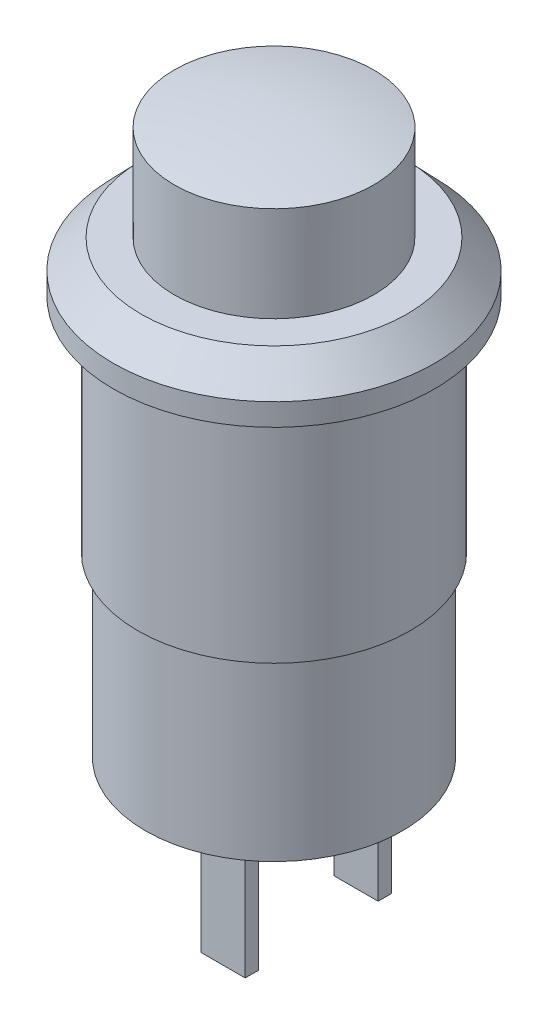
ISO-10303-21;
HEADER;
FILE_DESCRIPTION(('STEP AP214'),'2;1');
FILE_NAME('part.step','',(''),(''),'','','');
FILE_SCHEMA(('AUTOMOTIVE_DESIGN { 1 0 10303 214 1 1 1 1 }'));
ENDSEC;
DATA;
#1=APPLICATION_CONTEXT('core data for automotive mechanical design processes');
#2=APPLICATION_PROTOCOL_DEFINITION('international standard','automotive_design',2000,#1);
#3=PRODUCT_CONTEXT('',#1,'mechanical');
#4=PRODUCT('Part','Part','',(#3));
#5=PRODUCT_RELATED_PRODUCT_CATEGORY('part','',(#4));
#6=PRODUCT_DEFINITION_FORMATION('','',#4);
#7=PRODUCT_DEFINITION_CONTEXT('part definition',#1,'design');
#8=PRODUCT_DEFINITION('design','',#6,#7);
#9=PRODUCT_DEFINITION_SHAPE('','',#8);
#10=(LENGTH_UNIT() NAMED_UNIT(*) SI_UNIT(.MILLI.,.METRE.));
#11=(NAMED_UNIT(*) PLANE_ANGLE_UNIT() SI_UNIT($,.RADIAN.));
#12=(NAMED_UNIT(*) SI_UNIT($,.STERADIAN.) SOLID_ANGLE_UNIT());
#13=UNCERTAINTY_MEASURE_WITH_UNIT(LENGTH_MEASURE(1.E-05),#10,'distance_accuracy_value','');
#14=(GEOMETRIC_REPRESENTATION_CONTEXT(3) GLOBAL_UNCERTAINTY_ASSIGNED_CONTEXT((#13)) GLOBAL_UNIT_ASSIGNED_CONTEXT((#10,
#11,#12)) REPRESENTATION_CONTEXT('',''));
#15=CARTESIAN_POINT('',(0.,0.,0.));
#16=DIRECTION('',(0.,0.,1.));
#17=DIRECTION('',(1.,0.,0.));
#18=AXIS2_PLACEMENT_3D('',#15,#16,#17);
#19=CARTESIAN_POINT('',(-5.8,-18.,0.));
#20=DIRECTION('',(0.,-1.,0.));
#21=DIRECTION('',(0.,0.,-1.));
#22=AXIS2_PLACEMENT_3D('',#19,#20,#21);
#23=PLANE('',#22);
#24=CARTESIAN_POINT('',(0.,-18.,0.));
#25=DIRECTION('',(0.,1.,0.));
#26=DIRECTION('',(0.,0.,1.));
#27=AXIS2_PLACEMENT_3D('',#24,#25,#26);
#28=CIRCLE('',#27,5.8);
#29=CARTESIAN_POINT('',(0.,-18.,5.8));
#30=VERTEX_POINT('',#29);
#31=EDGE_CURVE('E11',#30,#30,#28,.T.);
#32=ORIENTED_EDGE('',*,*,#31,.F.);
#33=EDGE_LOOP('',(#32));
#34=FACE_BOUND('',#33,.T.);
#35=DIRECTION('',(1.,0.,0.));
#36=VECTOR('',#35,1.);
#37=CARTESIAN_POINT('',(0.,-18.,2.7));
#38=LINE('',#37,#36);
#39=CARTESIAN_POINT('',(0.,-18.,2.7));
#40=VERTEX_POINT('',#39);
#41=CARTESIAN_POINT('',(2.,-18.,2.7));
#42=VERTEX_POINT('',#41);
#43=EDGE_CURVE('E143',#40,#42,#38,.T.);
#44=ORIENTED_EDGE('',*,*,#43,.F.);
#45=DIRECTION('',(0.,0.,-1.));
#46=VECTOR('',#45,1.);
#47=CARTESIAN_POINT('',(0.,-18.,3.3));
#48=LINE('',#47,#46);
#49=CARTESIAN_POINT('',(0.,-18.,3.3));
#50=VERTEX_POINT('',#49);
#51=EDGE_CURVE('E138',#50,#40,#48,.T.);
#52=ORIENTED_EDGE('',*,*,#51,.F.);
#53=DIRECTION('',(-1.,0.,0.));
#54=VECTOR('',#53,1.);
#55=CARTESIAN_POINT('',(0.,-18.,3.3));
#56=LINE('',#55,#54);
#57=CARTESIAN_POINT('',(2.,-18.,3.3));
#58=VERTEX_POINT('',#57);
#59=EDGE_CURVE('E152',#58,#50,#56,.T.);
#60=ORIENTED_EDGE('',*,*,#59,.F.);
#61=DIRECTION('',(0.,0.,1.));
#62=VECTOR('',#61,1.);
#63=CARTESIAN_POINT('',(2.,-18.,3.3));
#64=LINE('',#63,#62);
#65=EDGE_CURVE('E161',#42,#58,#64,.T.);
#66=ORIENTED_EDGE('',*,*,#65,.F.);
#67=EDGE_LOOP('',(#44,#52,#60,#66));
#68=FACE_BOUND('',#67,.T.);
#69=DIRECTION('',(1.,0.,0.));
#70=VECTOR('',#69,1.);
#71=CARTESIAN_POINT('',(0.,-18.,-3.3));
#72=LINE('',#71,#70);
#73=CARTESIAN_POINT('',(0.,-18.,-3.3));
#74=VERTEX_POINT('',#73);
#75=CARTESIAN_POINT('',(2.,-18.,-3.3));
#76=VERTEX_POINT('',#75);
#77=EDGE_CURVE('E230',#74,#76,#72,.T.);
#78=ORIENTED_EDGE('',*,*,#77,.F.);
#79=DIRECTION('',(0.,0.,-1.));
#80=VECTOR('',#79,1.);
#81=CARTESIAN_POINT('',(0.,-18.,-2.7));
#82=LINE('',#81,#80);
#83=CARTESIAN_POINT('',(0.,-18.,-2.7));
#84=VERTEX_POINT('',#83);
#85=EDGE_CURVE('E135',#84,#74,#82,.T.);
#86=ORIENTED_EDGE('',*,*,#85,.F.);
#87=DIRECTION('',(-1.,0.,0.));
#88=VECTOR('',#87,1.);
#89=CARTESIAN_POINT('',(0.,-18.,-2.7));
#90=LINE('',#89,#88);
#91=CARTESIAN_POINT('',(2.,-18.,-2.7));
#92=VERTEX_POINT('',#91);
#93=EDGE_CURVE('E131',#92,#84,#90,.T.);
#94=ORIENTED_EDGE('',*,*,#93,.F.);
#95=DIRECTION('',(0.,0.,1.));
#96=VECTOR('',#95,1.);
#97=CARTESIAN_POINT('',(2.,-18.,-2.7));
#98=LINE('',#97,#96);
#99=EDGE_CURVE('E232',#76,#92,#98,.T.);
#100=ORIENTED_EDGE('',*,*,#99,.F.);
#101=EDGE_LOOP('',(#78,#86,#94,#100));
#102=FACE_BOUND('',#101,.T.);
#103=ADVANCED_FACE('F38',(#34,#68,#102),#23,.T.);
#104=CARTESIAN_POINT('',(0.,-13.4,0.));
#105=DIRECTION('',(0.,1.,0.));
#106=DIRECTION('',(-1.,0.,0.));
#107=AXIS2_PLACEMENT_3D('',#104,#105,#106);
#108=SPHERICAL_SURFACE('',#107,20.5);
#109=CARTESIAN_POINT('',(0.,6.6,0.));
#110=DIRECTION('',(0.,1.,0.));
#111=DIRECTION('',(0.,0.,1.));
#112=AXIS2_PLACEMENT_3D('',#109,#110,#111);
#113=CIRCLE('',#112,4.5);
#114=CARTESIAN_POINT('',(0.,6.6,4.5));
#115=VERTEX_POINT('',#114);
#116=EDGE_CURVE('E175',#115,#115,#113,.T.);
#117=ORIENTED_EDGE('',*,*,#116,.T.);
#118=EDGE_LOOP('',(#117));
#119=FACE_BOUND('',#118,.T.);
#120=ADVANCED_FACE('F40',(#119),#108,.T.);
#121=CARTESIAN_POINT('',(0.,17.963306774907,0.));
#122=DIRECTION('',(0.,1.,0.));
#123=DIRECTION('',(0.,0.,1.));
#124=AXIS2_PLACEMENT_3D('',#121,#122,#123);
#125=CYLINDRICAL_SURFACE('',#124,5.8);
#126=ORIENTED_EDGE('',*,*,#31,.T.);
#127=EDGE_LOOP('',(#126));
#128=FACE_BOUND('',#127,.T.);
#129=CARTESIAN_POINT('',(0.,-10.,0.));
#130=DIRECTION('',(0.,1.,0.));
#131=DIRECTION('',(0.,0.,1.));
#132=AXIS2_PLACEMENT_3D('',#129,#130,#131);
#133=CIRCLE('',#132,5.8);
#134=CARTESIAN_POINT('',(0.,-10.,5.8));
#135=VERTEX_POINT('',#134);
#136=EDGE_CURVE('E47',#135,#135,#133,.T.);
#137=ORIENTED_EDGE('',*,*,#136,.F.);
#138=EDGE_LOOP('',(#137));
#139=FACE_BOUND('',#138,.T.);
#140=ADVANCED_FACE('F208',(#128,#139),#125,.T.);
#141=CARTESIAN_POINT('',(-6.15,-10.,0.));
#142=DIRECTION('',(0.,-1.,0.));
#143=DIRECTION('',(0.,0.,-1.));
#144=AXIS2_PLACEMENT_3D('',#141,#142,#143);
#145=PLANE('',#144);
#146=ORIENTED_EDGE('',*,*,#136,.T.);
#147=EDGE_LOOP('',(#146));
#148=FACE_BOUND('',#147,.T.);
#149=CARTESIAN_POINT('',(0.,-10.,0.));
#150=DIRECTION('',(0.,1.,0.));
#151=DIRECTION('',(0.,0.,1.));
#152=AXIS2_PLACEMENT_3D('',#149,#150,#151);
#153=CIRCLE('',#152,6.15);
#154=CARTESIAN_POINT('',(0.,-10.,6.15));
#155=VERTEX_POINT('',#154);
#156=EDGE_CURVE('E198',#155,#155,#153,.T.);
#157=ORIENTED_EDGE('',*,*,#156,.F.);
#158=EDGE_LOOP('',(#157));
#159=FACE_BOUND('',#158,.T.);
#160=ADVANCED_FACE('F205',(#148,#159),#145,.T.);
#161=CARTESIAN_POINT('',(0.,17.963306774907,0.));
#162=DIRECTION('',(0.,1.,0.));
#163=DIRECTION('',(0.,0.,1.));
#164=AXIS2_PLACEMENT_3D('',#161,#162,#163);
#165=CYLINDRICAL_SURFACE('',#164,6.15);
#166=ORIENTED_EDGE('',*,*,#156,.T.);
#167=EDGE_LOOP('',(#166));
#168=FACE_BOUND('',#167,.T.);
#169=CARTESIAN_POINT('',(0.,0.,0.));
#170=DIRECTION('',(0.,1.,0.));
#171=DIRECTION('',(0.,0.,1.));
#172=AXIS2_PLACEMENT_3D('',#169,#170,#171);
#173=CIRCLE('',#172,6.15);
#174=CARTESIAN_POINT('',(0.,0.,6.15));
#175=VERTEX_POINT('',#174);
#176=EDGE_CURVE('E194',#175,#175,#173,.T.);
#177=ORIENTED_EDGE('',*,*,#176,.F.);
#178=EDGE_LOOP('',(#177));
#179=FACE_BOUND('',#178,.T.);
#180=ADVANCED_FACE('F216',(#168,#179),#165,.T.);
#181=CARTESIAN_POINT('',(-7.25,0.,0.));
#182=DIRECTION('',(0.,-1.,0.));
#183=DIRECTION('',(0.,0.,-1.));
#184=AXIS2_PLACEMENT_3D('',#181,#182,#183);
#185=PLANE('',#184);
#186=ORIENTED_EDGE('',*,*,#176,.T.);
#187=EDGE_LOOP('',(#186));
#188=FACE_BOUND('',#187,.T.);
#189=CARTESIAN_POINT('',(0.,0.,0.));
#190=DIRECTION('',(0.,1.,0.));
#191=DIRECTION('',(0.,0.,1.));
#192=AXIS2_PLACEMENT_3D('',#189,#190,#191);
#193=CIRCLE('',#192,7.25);
#194=CARTESIAN_POINT('',(0.,0.,7.25));
#195=VERTEX_POINT('',#194);
#196=EDGE_CURVE('E190',#195,#195,#193,.T.);
#197=ORIENTED_EDGE('',*,*,#196,.F.);
#198=EDGE_LOOP('',(#197));
#199=FACE_BOUND('',#198,.T.);
#200=ADVANCED_FACE('F294',(#188,#199),#185,.T.);
#201=CARTESIAN_POINT('',(0.,17.963306774907,0.));
#202=DIRECTION('',(0.,1.,0.));
#203=DIRECTION('',(0.,0.,1.));
#204=AXIS2_PLACEMENT_3D('',#201,#202,#203);
#205=CYLINDRICAL_SURFACE('',#204,7.25);
#206=ORIENTED_EDGE('',*,*,#196,.T.);
#207=EDGE_LOOP('',(#206));
#208=FACE_BOUND('',#207,.T.);
#209=CARTESIAN_POINT('',(0.,1.,0.));
#210=DIRECTION('',(0.,1.,0.));
#211=DIRECTION('',(0.,0.,1.));
#212=AXIS2_PLACEMENT_3D('',#209,#210,#211);
#213=CIRCLE('',#212,7.25);
#214=CARTESIAN_POINT('',(0.,1.,7.25));
#215=VERTEX_POINT('',#214);
#216=EDGE_CURVE('E186',#215,#215,#213,.T.);
#217=ORIENTED_EDGE('',*,*,#216,.F.);
#218=EDGE_LOOP('',(#217));
#219=FACE_BOUND('',#218,.T.);
#220=ADVANCED_FACE('F290',(#208,#219),#205,.T.);
#221=CARTESIAN_POINT('',(0.,2.3,0.));
#222=DIRECTION('',(0.,-1.,0.));
#223=DIRECTION('',(0.,0.,-1.));
#224=AXIS2_PLACEMENT_3D('',#221,#222,#223);
#225=CONICAL_SURFACE('',#224,6.,0.765792832540245);
#226=ORIENTED_EDGE('',*,*,#216,.T.);
#227=EDGE_LOOP('',(#226));
#228=FACE_BOUND('',#227,.T.);
#229=CARTESIAN_POINT('',(0.,2.3,0.));
#230=DIRECTION('',(0.,1.,0.));
#231=DIRECTION('',(0.,0.,1.));
#232=AXIS2_PLACEMENT_3D('',#229,#230,#231);
#233=CIRCLE('',#232,6.);
#234=CARTESIAN_POINT('',(0.,2.3,6.));
#235=VERTEX_POINT('',#234);
#236=EDGE_CURVE('E182',#235,#235,#233,.T.);
#237=ORIENTED_EDGE('',*,*,#236,.F.);
#238=EDGE_LOOP('',(#237));
#239=FACE_BOUND('',#238,.T.);
#240=ADVANCED_FACE('F286',(#228,#239),#225,.T.);
#241=CARTESIAN_POINT('',(-4.5,2.3,0.));
#242=DIRECTION('',(0.,1.,0.));
#243=DIRECTION('',(0.,0.,1.));
#244=AXIS2_PLACEMENT_3D('',#241,#242,#243);
#245=PLANE('',#244);
#246=ORIENTED_EDGE('',*,*,#236,.T.);
#247=EDGE_LOOP('',(#246));
#248=FACE_BOUND('',#247,.T.);
#249=CARTESIAN_POINT('',(0.,2.3,0.));
#250=DIRECTION('',(0.,1.,0.));
#251=DIRECTION('',(0.,0.,1.));
#252=AXIS2_PLACEMENT_3D('',#249,#250,#251);
#253=CIRCLE('',#252,4.5);
#254=CARTESIAN_POINT('',(0.,2.3,4.5));
#255=VERTEX_POINT('',#254);
#256=EDGE_CURVE('E178',#255,#255,#253,.T.);
#257=ORIENTED_EDGE('',*,*,#256,.F.);
#258=EDGE_LOOP('',(#257));
#259=FACE_BOUND('',#258,.T.);
#260=ADVANCED_FACE('F282',(#248,#259),#245,.T.);
#261=CARTESIAN_POINT('',(0.,17.963306774907,0.));
#262=DIRECTION('',(0.,1.,0.));
#263=DIRECTION('',(0.,0.,1.));
#264=AXIS2_PLACEMENT_3D('',#261,#262,#263);
#265=CYLINDRICAL_SURFACE('',#264,4.5);
#266=ORIENTED_EDGE('',*,*,#256,.T.);
#267=EDGE_LOOP('',(#266));
#268=FACE_BOUND('',#267,.T.);
#269=ORIENTED_EDGE('',*,*,#116,.F.);
#270=EDGE_LOOP('',(#269));
#271=FACE_BOUND('',#270,.T.);
#272=ADVANCED_FACE('F278',(#268,#271),#265,.T.);
#273=CARTESIAN_POINT('',(0.,-24.,3.3));
#274=DIRECTION('',(1.,0.,0.));
#275=DIRECTION('',(0.,0.,-1.));
#276=AXIS2_PLACEMENT_3D('',#273,#274,#275);
#277=PLANE('',#276);
#278=ORIENTED_EDGE('',*,*,#51,.T.);
#279=DIRECTION('',(0.,1.,0.));
#280=VECTOR('',#279,1.);
#281=CARTESIAN_POINT('',(0.,-24.,2.7));
#282=LINE('',#281,#280);
#283=CARTESIAN_POINT('',(0.,-24.,2.7));
#284=VERTEX_POINT('',#283);
#285=EDGE_CURVE('E172',#284,#40,#282,.T.);
#286=ORIENTED_EDGE('',*,*,#285,.F.);
#287=DIRECTION('',(0.,0.,-1.));
#288=VECTOR('',#287,1.);
#289=CARTESIAN_POINT('',(0.,-24.,3.3));
#290=LINE('',#289,#288);
#291=CARTESIAN_POINT('',(0.,-24.,3.3));
#292=VERTEX_POINT('',#291);
#293=EDGE_CURVE('E148',#292,#284,#290,.T.);
#294=ORIENTED_EDGE('',*,*,#293,.F.);
#295=DIRECTION('',(0.,1.,0.));
#296=VECTOR('',#295,1.);
#297=CARTESIAN_POINT('',(0.,-24.,3.3));
#298=LINE('',#297,#296);
#299=EDGE_CURVE('E157',#292,#50,#298,.T.);
#300=ORIENTED_EDGE('',*,*,#299,.T.);
#301=EDGE_LOOP('',(#278,#286,#294,#300));
#302=FACE_BOUND('',#301,.T.);
#303=ADVANCED_FACE('F274',(#302),#277,.F.);
#304=CARTESIAN_POINT('',(0.,-24.,2.7));
#305=DIRECTION('',(0.,0.,1.));
#306=DIRECTION('',(1.,0.,0.));
#307=AXIS2_PLACEMENT_3D('',#304,#305,#306);
#308=PLANE('',#307);
#309=ORIENTED_EDGE('',*,*,#43,.T.);
#310=DIRECTION('',(0.,1.,0.));
#311=VECTOR('',#310,1.);
#312=CARTESIAN_POINT('',(2.,-24.,2.7));
#313=LINE('',#312,#311);
#314=CARTESIAN_POINT('',(2.,-24.,2.7));
#315=VERTEX_POINT('',#314);
#316=EDGE_CURVE('E169',#315,#42,#313,.T.);
#317=ORIENTED_EDGE('',*,*,#316,.F.);
#318=DIRECTION('',(1.,0.,0.));
#319=VECTOR('',#318,1.);
#320=CARTESIAN_POINT('',(0.,-24.,2.7));
#321=LINE('',#320,#319);
#322=EDGE_CURVE('E151',#284,#315,#321,.T.);
#323=ORIENTED_EDGE('',*,*,#322,.F.);
#324=ORIENTED_EDGE('',*,*,#285,.T.);
#325=EDGE_LOOP('',(#309,#317,#323,#324));
#326=FACE_BOUND('',#325,.T.);
#327=ADVANCED_FACE('F270',(#326),#308,.F.);
#328=CARTESIAN_POINT('',(2.,-24.,3.3));
#329=DIRECTION('',(-1.,0.,0.));
#330=DIRECTION('',(0.,0.,1.));
#331=AXIS2_PLACEMENT_3D('',#328,#329,#330);
#332=PLANE('',#331);
#333=ORIENTED_EDGE('',*,*,#65,.T.);
#334=DIRECTION('',(0.,1.,0.));
#335=VECTOR('',#334,1.);
#336=CARTESIAN_POINT('',(2.,-24.,3.3));
#337=LINE('',#336,#335);
#338=CARTESIAN_POINT('',(2.,-24.,3.3));
#339=VERTEX_POINT('',#338);
#340=EDGE_CURVE('E62',#339,#58,#337,.T.);
#341=ORIENTED_EDGE('',*,*,#340,.F.);
#342=DIRECTION('',(0.,0.,1.));
#343=VECTOR('',#342,1.);
#344=CARTESIAN_POINT('',(2.,-24.,3.3));
#345=LINE('',#344,#343);
#346=EDGE_CURVE('E154',#315,#339,#345,.T.);
#347=ORIENTED_EDGE('',*,*,#346,.F.);
#348=ORIENTED_EDGE('',*,*,#316,.T.);
#349=EDGE_LOOP('',(#333,#341,#347,#348));
#350=FACE_BOUND('',#349,.T.);
#351=ADVANCED_FACE('F267',(#350),#332,.F.);
#352=CARTESIAN_POINT('',(0.,-24.,3.3));
#353=DIRECTION('',(0.,0.,-1.));
#354=DIRECTION('',(-1.,0.,0.));
#355=AXIS2_PLACEMENT_3D('',#352,#353,#354);
#356=PLANE('',#355);
#357=ORIENTED_EDGE('',*,*,#59,.T.);
#358=ORIENTED_EDGE('',*,*,#299,.F.);
#359=DIRECTION('',(-1.,0.,0.));
#360=VECTOR('',#359,1.);
#361=CARTESIAN_POINT('',(0.,-24.,3.3));
#362=LINE('',#361,#360);
#363=EDGE_CURVE('E156',#339,#292,#362,.T.);
#364=ORIENTED_EDGE('',*,*,#363,.F.);
#365=ORIENTED_EDGE('',*,*,#340,.T.);
#366=EDGE_LOOP('',(#357,#358,#364,#365));
#367=FACE_BOUND('',#366,.T.);
#368=ADVANCED_FACE('F263',(#367),#356,.F.);
#369=CARTESIAN_POINT('',(0.,-24.,0.));
#370=DIRECTION('',(0.,-1.,0.));
#371=DIRECTION('',(0.,0.,-1.));
#372=AXIS2_PLACEMENT_3D('',#369,#370,#371);
#373=PLANE('',#372);
#374=ORIENTED_EDGE('',*,*,#293,.T.);
#375=ORIENTED_EDGE('',*,*,#322,.T.);
#376=ORIENTED_EDGE('',*,*,#346,.T.);
#377=ORIENTED_EDGE('',*,*,#363,.T.);
#378=EDGE_LOOP('',(#374,#375,#376,#377));
#379=FACE_BOUND('',#378,.T.);
#380=ADVANCED_FACE('F260',(#379),#373,.T.);
#381=CARTESIAN_POINT('',(0.,-24.,-2.7));
#382=DIRECTION('',(1.,0.,0.));
#383=DIRECTION('',(0.,0.,-1.));
#384=AXIS2_PLACEMENT_3D('',#381,#382,#383);
#385=PLANE('',#384);
#386=ORIENTED_EDGE('',*,*,#85,.T.);
#387=DIRECTION('',(0.,1.,0.));
#388=VECTOR('',#387,1.);
#389=CARTESIAN_POINT('',(0.,-24.,-3.3));
#390=LINE('',#389,#388);
#391=CARTESIAN_POINT('',(0.,-24.,-3.3));
#392=VERTEX_POINT('',#391);
#393=EDGE_CURVE('E114',#392,#74,#390,.T.);
#394=ORIENTED_EDGE('',*,*,#393,.F.);
#395=DIRECTION('',(0.,0.,-1.));
#396=VECTOR('',#395,1.);
#397=CARTESIAN_POINT('',(0.,-24.,-2.7));
#398=LINE('',#397,#396);
#399=CARTESIAN_POINT('',(0.,-24.,-2.7));
#400=VERTEX_POINT('',#399);
#401=EDGE_CURVE('E122',#400,#392,#398,.T.);
#402=ORIENTED_EDGE('',*,*,#401,.F.);
#403=DIRECTION('',(0.,1.,0.));
#404=VECTOR('',#403,1.);
#405=CARTESIAN_POINT('',(0.,-24.,-2.7));
#406=LINE('',#405,#404);
#407=EDGE_CURVE('E241',#400,#84,#406,.T.);
#408=ORIENTED_EDGE('',*,*,#407,.T.);
#409=EDGE_LOOP('',(#386,#394,#402,#408));
#410=FACE_BOUND('',#409,.T.);
#411=ADVANCED_FACE('F133',(#410),#385,.F.);
#412=CARTESIAN_POINT('',(0.,-24.,-3.3));
#413=DIRECTION('',(0.,0.,1.));
#414=DIRECTION('',(1.,0.,0.));
#415=AXIS2_PLACEMENT_3D('',#412,#413,#414);
#416=PLANE('',#415);
#417=ORIENTED_EDGE('',*,*,#77,.T.);
#418=DIRECTION('',(0.,1.,0.));
#419=VECTOR('',#418,1.);
#420=CARTESIAN_POINT('',(2.,-24.,-3.3));
#421=LINE('',#420,#419);
#422=CARTESIAN_POINT('',(2.,-24.,-3.3));
#423=VERTEX_POINT('',#422);
#424=EDGE_CURVE('E117',#423,#76,#421,.T.);
#425=ORIENTED_EDGE('',*,*,#424,.F.);
#426=DIRECTION('',(1.,0.,0.));
#427=VECTOR('',#426,1.);
#428=CARTESIAN_POINT('',(0.,-24.,-3.3));
#429=LINE('',#428,#427);
#430=EDGE_CURVE('E110',#392,#423,#429,.T.);
#431=ORIENTED_EDGE('',*,*,#430,.F.);
#432=ORIENTED_EDGE('',*,*,#393,.T.);
#433=EDGE_LOOP('',(#417,#425,#431,#432));
#434=FACE_BOUND('',#433,.T.);
#435=ADVANCED_FACE('F112',(#434),#416,.F.);
#436=CARTESIAN_POINT('',(2.,-24.,-2.7));
#437=DIRECTION('',(-1.,0.,0.));
#438=DIRECTION('',(0.,0.,1.));
#439=AXIS2_PLACEMENT_3D('',#436,#437,#438);
#440=PLANE('',#439);
#441=ORIENTED_EDGE('',*,*,#99,.T.);
#442=DIRECTION('',(0.,1.,0.));
#443=VECTOR('',#442,1.);
#444=CARTESIAN_POINT('',(2.,-24.,-2.7));
#445=LINE('',#444,#443);
#446=CARTESIAN_POINT('',(2.,-24.,-2.7));
#447=VERTEX_POINT('',#446);
#448=EDGE_CURVE('E54',#447,#92,#445,.T.);
#449=ORIENTED_EDGE('',*,*,#448,.F.);
#450=DIRECTION('',(0.,0.,1.));
#451=VECTOR('',#450,1.);
#452=CARTESIAN_POINT('',(2.,-24.,-2.7));
#453=LINE('',#452,#451);
#454=EDGE_CURVE('E121',#423,#447,#453,.T.);
#455=ORIENTED_EDGE('',*,*,#454,.F.);
#456=ORIENTED_EDGE('',*,*,#424,.T.);
#457=EDGE_LOOP('',(#441,#449,#455,#456));
#458=FACE_BOUND('',#457,.T.);
#459=ADVANCED_FACE('F245',(#458),#440,.F.);
#460=CARTESIAN_POINT('',(0.,-24.,-2.7));
#461=DIRECTION('',(0.,0.,-1.));
#462=DIRECTION('',(-1.,0.,0.));
#463=AXIS2_PLACEMENT_3D('',#460,#461,#462);
#464=PLANE('',#463);
#465=ORIENTED_EDGE('',*,*,#93,.T.);
#466=ORIENTED_EDGE('',*,*,#407,.F.);
#467=DIRECTION('',(-1.,0.,0.));
#468=VECTOR('',#467,1.);
#469=CARTESIAN_POINT('',(0.,-24.,-2.7));
#470=LINE('',#469,#468);
#471=EDGE_CURVE('E126',#447,#400,#470,.T.);
#472=ORIENTED_EDGE('',*,*,#471,.F.);
#473=ORIENTED_EDGE('',*,*,#448,.T.);
#474=EDGE_LOOP('',(#465,#466,#472,#473));
#475=FACE_BOUND('',#474,.T.);
#476=ADVANCED_FACE('F246',(#475),#464,.F.);
#477=CARTESIAN_POINT('',(0.,-24.,0.));
#478=DIRECTION('',(0.,-1.,0.));
#479=DIRECTION('',(0.,0.,-1.));
#480=AXIS2_PLACEMENT_3D('',#477,#478,#479);
#481=PLANE('',#480);
#482=ORIENTED_EDGE('',*,*,#401,.T.);
#483=ORIENTED_EDGE('',*,*,#430,.T.);
#484=ORIENTED_EDGE('',*,*,#454,.T.);
#485=ORIENTED_EDGE('',*,*,#471,.T.);
#486=EDGE_LOOP('',(#482,#483,#484,#485));
#487=FACE_BOUND('',#486,.T.);
#488=ADVANCED_FACE('F125',(#487),#481,.T.);
#489=CLOSED_SHELL('',(#103,#120,#140,#160,#180,#200,#220,#240,#260,#272,#303,#327,#351,#368,
#380,#411,#435,#459,#476,#488));
#490=MANIFOLD_SOLID_BREP('B2',#489);
#491=ADVANCED_BREP_SHAPE_REPRESENTATION('',(#18,#490),#14);
#492=SHAPE_DEFINITION_REPRESENTATION(#9,#491);
ENDSEC;
END-ISO-10303-21;
